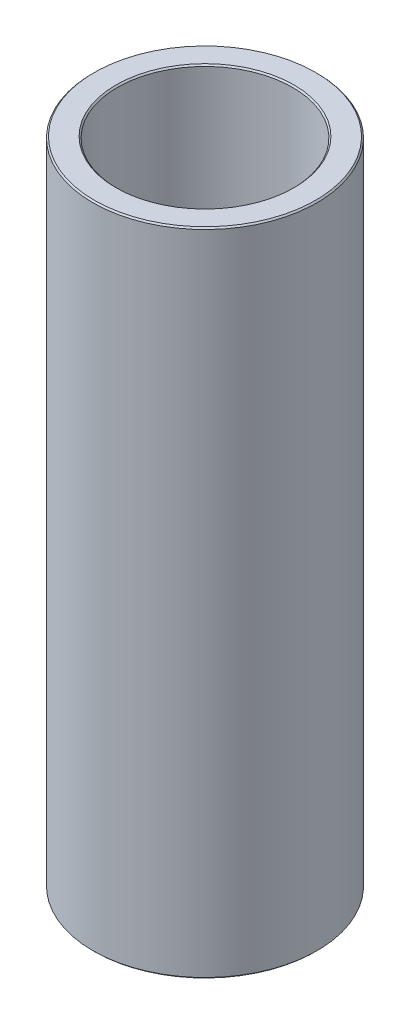
ISO-10303-21;
HEADER;
FILE_DESCRIPTION(('STEP AP214'),'2;1');
FILE_NAME('part.step','',(''),(''),'','','');
FILE_SCHEMA(('AUTOMOTIVE_DESIGN { 1 0 10303 214 1 1 1 1 }'));
ENDSEC;
DATA;
#1=APPLICATION_CONTEXT('core data for automotive mechanical design processes');
#2=APPLICATION_PROTOCOL_DEFINITION('international standard','automotive_design',2000,#1);
#3=PRODUCT_CONTEXT('',#1,'mechanical');
#4=PRODUCT('Part','Part','',(#3));
#5=PRODUCT_RELATED_PRODUCT_CATEGORY('part','',(#4));
#6=PRODUCT_DEFINITION_FORMATION('','',#4);
#7=PRODUCT_DEFINITION_CONTEXT('part definition',#1,'design');
#8=PRODUCT_DEFINITION('design','',#6,#7);
#9=PRODUCT_DEFINITION_SHAPE('','',#8);
#10=(LENGTH_UNIT() NAMED_UNIT(*) SI_UNIT(.MILLI.,.METRE.));
#11=(NAMED_UNIT(*) PLANE_ANGLE_UNIT() SI_UNIT($,.RADIAN.));
#12=(NAMED_UNIT(*) SI_UNIT($,.STERADIAN.) SOLID_ANGLE_UNIT());
#13=UNCERTAINTY_MEASURE_WITH_UNIT(LENGTH_MEASURE(1.E-05),#10,'distance_accuracy_value','');
#14=(GEOMETRIC_REPRESENTATION_CONTEXT(3) GLOBAL_UNCERTAINTY_ASSIGNED_CONTEXT((#13)) GLOBAL_UNIT_ASSIGNED_CONTEXT((#10,
#11,#12)) REPRESENTATION_CONTEXT('',''));
#15=CARTESIAN_POINT('',(0.,0.,0.));
#16=DIRECTION('',(0.,0.,1.));
#17=DIRECTION('',(1.,0.,0.));
#18=AXIS2_PLACEMENT_3D('',#15,#16,#17);
#19=CARTESIAN_POINT('',(0.,203.105967648704,0.));
#20=DIRECTION('',(0.,-1.,0.));
#21=DIRECTION('',(0.,0.,-1.));
#22=AXIS2_PLACEMENT_3D('',#19,#20,#21);
#23=CYLINDRICAL_SURFACE('',#22,35.);
#24=CARTESIAN_POINT('',(0.,0.441228143377187,0.));
#25=DIRECTION('',(0.,1.,0.));
#26=DIRECTION('',(0.,0.,1.));
#27=AXIS2_PLACEMENT_3D('',#24,#25,#26);
#28=CIRCLE('',#27,35.);
#29=CARTESIAN_POINT('',(0.,0.441228143377187,-35.));
#30=VERTEX_POINT('',#29);
#31=EDGE_CURVE('E10',#30,#30,#28,.T.);
#32=CARTESIAN_POINT('',(0.,202.664739505327,0.));
#33=DIRECTION('',(0.,1.,0.));
#34=DIRECTION('',(0.,0.,1.));
#35=AXIS2_PLACEMENT_3D('',#32,#33,#34);
#36=CIRCLE('',#35,35.);
#37=CARTESIAN_POINT('',(0.,202.664739505327,-35.));
#38=VERTEX_POINT('',#37);
#39=EDGE_CURVE('E50',#38,#38,#36,.F.);
#40=CARTESIAN_POINT('',(0.,0.441228143377187,-35.));
#41=CARTESIAN_POINT('',(0.,2.5477230533975,-35.));
#42=CARTESIAN_POINT('',(0.,4.65421796341781,-35.));
#43=CARTESIAN_POINT('',(0.,8.86720778345843,-35.));
#44=CARTESIAN_POINT('',(0.,10.9737026934787,-35.));
#45=CARTESIAN_POINT('',(0.,15.1866925135193,-35.));
#46=CARTESIAN_POINT('',(0.,17.2931874235397,-35.));
#47=CARTESIAN_POINT('',(0.,21.5061772435803,-35.));
#48=CARTESIAN_POINT('',(0.,23.6126721536006,-35.));
#49=CARTESIAN_POINT('',(0.,27.8256619736412,-35.));
#50=CARTESIAN_POINT('',(0.,29.9321568836615,-35.));
#51=CARTESIAN_POINT('',(0.,34.1451467037021,-35.));
#52=CARTESIAN_POINT('',(0.,36.2516416137225,-35.));
#53=CARTESIAN_POINT('',(0.,40.4646314337631,-35.));
#54=CARTESIAN_POINT('',(0.,42.5711263437834,-35.));
#55=CARTESIAN_POINT('',(0.,46.784116163824,-35.));
#56=CARTESIAN_POINT('',(0.,48.8906110738443,-35.));
#57=CARTESIAN_POINT('',(0.,53.1036008938849,-35.));
#58=CARTESIAN_POINT('',(0.,55.2100958039052,-35.));
#59=CARTESIAN_POINT('',(0.,59.4230856239459,-35.));
#60=CARTESIAN_POINT('',(0.,61.5295805339662,-35.));
#61=CARTESIAN_POINT('',(0.,65.7425703540068,-35.));
#62=CARTESIAN_POINT('',(0.,67.8490652640271,-35.));
#63=CARTESIAN_POINT('',(0.,72.0620550840677,-35.));
#64=CARTESIAN_POINT('',(0.,74.168549994088,-35.));
#65=CARTESIAN_POINT('',(0.,78.3815398141286,-35.));
#66=CARTESIAN_POINT('',(0.,80.4880347241489,-35.));
#67=CARTESIAN_POINT('',(0.,84.7010245441896,-35.));
#68=CARTESIAN_POINT('',(0.,86.8075194542099,-35.));
#69=CARTESIAN_POINT('',(0.,91.0205092742505,-35.));
#70=CARTESIAN_POINT('',(0.,93.1270041842708,-35.));
#71=CARTESIAN_POINT('',(0.,97.3399940043114,-35.));
#72=CARTESIAN_POINT('',(0.,99.4464889143317,-35.));
#73=CARTESIAN_POINT('',(0.,103.659478734372,-35.));
#74=CARTESIAN_POINT('',(0.,105.765973644393,-35.));
#75=CARTESIAN_POINT('',(0.,109.978963464433,-35.));
#76=CARTESIAN_POINT('',(0.,112.085458374454,-35.));
#77=CARTESIAN_POINT('',(0.,116.298448194494,-35.));
#78=CARTESIAN_POINT('',(0.,118.404943104515,-35.));
#79=CARTESIAN_POINT('',(0.,122.617932924555,-35.));
#80=CARTESIAN_POINT('',(0.,124.724427834575,-35.));
#81=CARTESIAN_POINT('',(0.,128.937417654616,-35.));
#82=CARTESIAN_POINT('',(0.,131.043912564636,-35.));
#83=CARTESIAN_POINT('',(0.,135.256902384677,-35.));
#84=CARTESIAN_POINT('',(0.,137.363397294697,-35.));
#85=CARTESIAN_POINT('',(0.,141.576387114738,-35.));
#86=CARTESIAN_POINT('',(0.,143.682882024758,-35.));
#87=CARTESIAN_POINT('',(0.,147.895871844799,-35.));
#88=CARTESIAN_POINT('',(0.,150.002366754819,-35.));
#89=CARTESIAN_POINT('',(0.,154.21535657486,-35.));
#90=CARTESIAN_POINT('',(0.,156.32185148488,-35.));
#91=CARTESIAN_POINT('',(0.,160.534841304921,-35.));
#92=CARTESIAN_POINT('',(0.,162.641336214941,-35.));
#93=CARTESIAN_POINT('',(0.,166.854326034982,-35.));
#94=CARTESIAN_POINT('',(0.,168.960820945002,-35.));
#95=CARTESIAN_POINT('',(0.,173.173810765043,-35.));
#96=CARTESIAN_POINT('',(0.,175.280305675063,-35.));
#97=CARTESIAN_POINT('',(0.,179.493295495104,-35.));
#98=CARTESIAN_POINT('',(0.,181.599790405124,-35.));
#99=CARTESIAN_POINT('',(0.,185.812780225164,-35.));
#100=CARTESIAN_POINT('',(0.,187.919275135185,-35.));
#101=CARTESIAN_POINT('',(0.,192.132264955225,-35.));
#102=CARTESIAN_POINT('',(0.,194.238759865246,-35.));
#103=CARTESIAN_POINT('',(0.,198.451749685286,-35.));
#104=CARTESIAN_POINT('',(0.,200.558244595307,-35.));
#105=CARTESIAN_POINT('',(0.,202.664739505327,-35.));
#106=B_SPLINE_CURVE_WITH_KNOTS('',3,(#40,#41,#42,#43,#44,#45,#46,#47,#48,#49,#50,#51,#52,#53,
#54,#55,#56,#57,#58,#59,#60,#61,#62,#63,#64,#65,#66,#67,#68,#69,#70,#71,#72,#73,#74,#75,#76,#77,
#78,#79,#80,#81,#82,#83,#84,#85,#86,#87,#88,#89,#90,#91,#92,#93,#94,#95,#96,#97,#98,#99,#100,
#101,#102,#103,#104,#105),.UNSPECIFIED.,.F.,.F.,(4,2,2,2,2,2,2,2,2,2,2,2,2,2,2,2,2,2,2,2,2,2,2,
2,2,2,2,2,2,2,2,2,4),(0.,6.31948473006094,12.6389694601219,18.9584541901828,25.2779389202437,
31.5974236503047,37.9169083803656,44.2363931104265,50.5558778404874,56.8753625705484,
63.1948473006093,69.5143320306702,75.8338167607311,82.1533014907921,88.472786220853,
94.7922709509139,101.111755680975,107.431240411036,113.750725141097,120.070209871158,
126.389694601219,132.70917933128,139.02866406134,145.348148791401,151.667633521462,
157.987118251523,164.306602981584,170.626087711645,176.945572441706,183.265057171767,
189.584541901828,195.904026631889,202.22351136195),.UNSPECIFIED.);
#107=EDGE_CURVE('BSEAM39',#30,#38,#106,.T.);
#108=ORIENTED_EDGE('',*,*,#31,.T.);
#109=ORIENTED_EDGE('',*,*,#39,.T.);
#110=ORIENTED_EDGE('',*,*,#107,.T.);
#111=ORIENTED_EDGE('',*,*,#107,.F.);
#112=EDGE_LOOP('',(#108,#110,#109,#111));
#113=FACE_BOUND('',#112,.T.);
#114=ADVANCED_FACE('F39',(#113),#23,.T.);
#115=CARTESIAN_POINT('',(0.,203.105967648704,0.));
#116=DIRECTION('',(0.,1.,0.));
#117=DIRECTION('',(0.,0.,1.));
#118=AXIS2_PLACEMENT_3D('',#115,#116,#117);
#119=PLANE('',#118);
#120=CARTESIAN_POINT('',(0.,203.105967648704,0.));
#121=DIRECTION('',(0.,1.,0.));
#122=DIRECTION('',(0.,0.,1.));
#123=AXIS2_PLACEMENT_3D('',#120,#121,#122);
#124=CIRCLE('',#123,27.8027280237474);
#125=CARTESIAN_POINT('',(0.,203.105967648704,27.8027280237473));
#126=VERTEX_POINT('',#125);
#127=EDGE_CURVE('E58',#126,#126,#124,.F.);
#128=ORIENTED_EDGE('',*,*,#127,.T.);
#129=EDGE_LOOP('',(#128));
#130=FACE_BOUND('',#129,.T.);
#131=CARTESIAN_POINT('',(0.,203.105967648704,0.));
#132=DIRECTION('',(0.,1.,0.));
#133=DIRECTION('',(0.,0.,1.));
#134=AXIS2_PLACEMENT_3D('',#131,#132,#133);
#135=CIRCLE('',#134,34.5587718566228);
#136=CARTESIAN_POINT('',(0.,203.105967648704,-34.5587718566228));
#137=VERTEX_POINT('',#136);
#138=EDGE_CURVE('E61',#137,#137,#135,.T.);
#139=ORIENTED_EDGE('',*,*,#138,.T.);
#140=EDGE_LOOP('',(#139));
#141=FACE_BOUND('',#140,.T.);
#142=ADVANCED_FACE('F88',(#130,#141),#119,.T.);
#143=CARTESIAN_POINT('',(0.,0.,0.));
#144=DIRECTION('',(0.,1.,0.));
#145=DIRECTION('',(0.,0.,1.));
#146=AXIS2_PLACEMENT_3D('',#143,#144,#145);
#147=PLANE('',#146);
#148=CARTESIAN_POINT('',(0.,0.,0.));
#149=DIRECTION('',(0.,1.,0.));
#150=DIRECTION('',(0.,0.,1.));
#151=AXIS2_PLACEMENT_3D('',#148,#149,#150);
#152=CIRCLE('',#151,27.8027280237474);
#153=CARTESIAN_POINT('',(0.,0.,27.8027280237474));
#154=VERTEX_POINT('',#153);
#155=EDGE_CURVE('E51',#154,#154,#152,.T.);
#156=ORIENTED_EDGE('',*,*,#155,.T.);
#157=EDGE_LOOP('',(#156));
#158=FACE_BOUND('',#157,.T.);
#159=CARTESIAN_POINT('',(0.,0.,0.));
#160=DIRECTION('',(0.,1.,0.));
#161=DIRECTION('',(0.,0.,1.));
#162=AXIS2_PLACEMENT_3D('',#159,#160,#161);
#163=CIRCLE('',#162,34.5587718566228);
#164=CARTESIAN_POINT('',(0.,0.,34.5587718566228));
#165=VERTEX_POINT('',#164);
#166=EDGE_CURVE('E54',#165,#165,#163,.F.);
#167=ORIENTED_EDGE('',*,*,#166,.T.);
#168=EDGE_LOOP('',(#167));
#169=FACE_BOUND('',#168,.T.);
#170=ADVANCED_FACE('F83',(#158,#169),#147,.F.);
#171=CARTESIAN_POINT('',(0.,203.105967648704,0.));
#172=DIRECTION('',(0.,-1.,0.));
#173=DIRECTION('',(0.,0.,-1.));
#174=AXIS2_PLACEMENT_3D('',#171,#172,#173);
#175=CYLINDRICAL_SURFACE('',#174,27.3614998803701);
#176=CARTESIAN_POINT('',(0.,202.664739505327,0.));
#177=DIRECTION('',(0.,1.,0.));
#178=DIRECTION('',(0.,0.,1.));
#179=AXIS2_PLACEMENT_3D('',#176,#177,#178);
#180=CIRCLE('',#179,27.3614998803701);
#181=CARTESIAN_POINT('',(0.,202.664739505327,27.3614998803701));
#182=VERTEX_POINT('',#181);
#183=EDGE_CURVE('E67',#182,#182,#180,.T.);
#184=ORIENTED_EDGE('',*,*,#183,.T.);
#185=EDGE_LOOP('',(#184));
#186=FACE_BOUND('',#185,.T.);
#187=CARTESIAN_POINT('',(0.,0.44122814337727,0.));
#188=DIRECTION('',(0.,1.,0.));
#189=DIRECTION('',(0.,0.,1.));
#190=AXIS2_PLACEMENT_3D('',#187,#188,#189);
#191=CIRCLE('',#190,27.3614998803701);
#192=CARTESIAN_POINT('',(0.,0.44122814337727,27.3614998803701));
#193=VERTEX_POINT('',#192);
#194=EDGE_CURVE('E69',#193,#193,#191,.F.);
#195=ORIENTED_EDGE('',*,*,#194,.T.);
#196=EDGE_LOOP('',(#195));
#197=FACE_BOUND('',#196,.T.);
#198=ADVANCED_FACE('F71',(#186,#197),#175,.F.);
#199=CARTESIAN_POINT('',(0.,202.664739505327,0.));
#200=DIRECTION('',(0.,1.,0.));
#201=DIRECTION('',(0.,0.,1.));
#202=AXIS2_PLACEMENT_3D('',#199,#200,#201);
#203=CONICAL_SURFACE('',#202,27.3614998803701,0.785398163397429);
#204=CARTESIAN_POINT('',(0.,203.105967648704,27.8027280237473));
#205=CARTESIAN_POINT('',(0.,203.101371522211,27.7981318972538));
#206=CARTESIAN_POINT('',(0.,203.096775395717,27.7935357707603));
#207=CARTESIAN_POINT('',(0.,203.08758314273,27.7843435177733));
#208=CARTESIAN_POINT('',(0.,203.082987016237,27.7797473912798));
#209=CARTESIAN_POINT('',(0.,203.07379476325,27.7705551382928));
#210=CARTESIAN_POINT('',(0.,203.069198636756,27.7659590117993));
#211=CARTESIAN_POINT('',(0.,203.060006383769,27.7567667588122));
#212=CARTESIAN_POINT('',(0.,203.055410257275,27.7521706323187));
#213=CARTESIAN_POINT('',(0.,203.046218004288,27.7429783793317));
#214=CARTESIAN_POINT('',(0.,203.041621877795,27.7383822528382));
#215=CARTESIAN_POINT('',(0.,203.032429624808,27.7291899998511));
#216=CARTESIAN_POINT('',(0.,203.027833498314,27.7245938733576));
#217=CARTESIAN_POINT('',(0.,203.018641245327,27.7154016203706));
#218=CARTESIAN_POINT('',(0.,203.014045118834,27.7108054938771));
#219=CARTESIAN_POINT('',(0.,203.004852865847,27.7016132408901));
#220=CARTESIAN_POINT('',(0.,203.000256739353,27.6970171143966));
#221=CARTESIAN_POINT('',(0.,202.991064486366,27.6878248614095));
#222=CARTESIAN_POINT('',(0.,202.986468359873,27.683228734916));
#223=CARTESIAN_POINT('',(0.,202.977276106886,27.674036481929));
#224=CARTESIAN_POINT('',(0.,202.972679980392,27.6694403554355));
#225=CARTESIAN_POINT('',(0.,202.963487727405,27.6602481024485));
#226=CARTESIAN_POINT('',(0.,202.958891600912,27.6556519759549));
#227=CARTESIAN_POINT('',(0.,202.949699347925,27.6464597229679));
#228=CARTESIAN_POINT('',(0.,202.945103221431,27.6418635964744));
#229=CARTESIAN_POINT('',(0.,202.935910968444,27.6326713434874));
#230=CARTESIAN_POINT('',(0.,202.931314841951,27.6280752169939));
#231=CARTESIAN_POINT('',(0.,202.922122588964,27.6188829640068));
#232=CARTESIAN_POINT('',(0.,202.91752646247,27.6142868375133));
#233=CARTESIAN_POINT('',(0.,202.908334209483,27.6050945845263));
#234=CARTESIAN_POINT('',(0.,202.90373808299,27.6004984580328));
#235=CARTESIAN_POINT('',(0.,202.894545830003,27.5913062050458));
#236=CARTESIAN_POINT('',(0.,202.889949703509,27.5867100785523));
#237=CARTESIAN_POINT('',(0.,202.880757450522,27.5775178255652));
#238=CARTESIAN_POINT('',(0.,202.876161324028,27.5729216990717));
#239=CARTESIAN_POINT('',(0.,202.866969071041,27.5637294460847));
#240=CARTESIAN_POINT('',(0.,202.862372944548,27.5591333195912));
#241=CARTESIAN_POINT('',(0.,202.853180691561,27.5499410666042));
#242=CARTESIAN_POINT('',(0.,202.848584565067,27.5453449401106));
#243=CARTESIAN_POINT('',(0.,202.83939231208,27.5361526871236));
#244=CARTESIAN_POINT('',(0.,202.834796185587,27.5315565606301));
#245=CARTESIAN_POINT('',(0.,202.8256039326,27.5223643076431));
#246=CARTESIAN_POINT('',(0.,202.821007806106,27.5177681811496));
#247=CARTESIAN_POINT('',(0.,202.811815553119,27.5085759281625));
#248=CARTESIAN_POINT('',(0.,202.807219426626,27.503979801669));
#249=CARTESIAN_POINT('',(0.,202.798027173639,27.494787548682));
#250=CARTESIAN_POINT('',(0.,202.793431047145,27.4901914221885));
#251=CARTESIAN_POINT('',(0.,202.784238794158,27.4809991692015));
#252=CARTESIAN_POINT('',(0.,202.779642667665,27.4764030427079));
#253=CARTESIAN_POINT('',(0.,202.770450414678,27.4672107897209));
#254=CARTESIAN_POINT('',(0.,202.765854288184,27.4626146632274));
#255=CARTESIAN_POINT('',(0.,202.756662035197,27.4534224102404));
#256=CARTESIAN_POINT('',(0.,202.752065908704,27.4488262837469));
#257=CARTESIAN_POINT('',(0.,202.742873655717,27.4396340307598));
#258=CARTESIAN_POINT('',(0.,202.738277529223,27.4350379042663));
#259=CARTESIAN_POINT('',(0.,202.729085276236,27.4258456512793));
#260=CARTESIAN_POINT('',(0.,202.724489149743,27.4212495247858));
#261=CARTESIAN_POINT('',(0.,202.715296896756,27.4120572717988));
#262=CARTESIAN_POINT('',(0.,202.710700770262,27.4074611453053));
#263=CARTESIAN_POINT('',(0.,202.701508517275,27.3982688923182));
#264=CARTESIAN_POINT('',(0.,202.696912390782,27.3936727658247));
#265=CARTESIAN_POINT('',(0.,202.687720137794,27.3844805128377));
#266=CARTESIAN_POINT('',(0.,202.683124011301,27.3798843863442));
#267=CARTESIAN_POINT('',(0.,202.673931758314,27.3706921333572));
#268=CARTESIAN_POINT('',(0.,202.66933563182,27.3660960068636));
#269=CARTESIAN_POINT('',(0.,202.664739505327,27.3614998803701));
#270=B_SPLINE_CURVE_WITH_KNOTS('',3,(#204,#205,#206,#207,#208,#209,#210,#211,#212,#213,#214,
#215,#216,#217,#218,#219,#220,#221,#222,#223,#224,#225,#226,#227,#228,#229,#230,#231,#232,#233,
#234,#235,#236,#237,#238,#239,#240,#241,#242,#243,#244,#245,#246,#247,#248,#249,#250,#251,#252,
#253,#254,#255,#256,#257,#258,#259,#260,#261,#262,#263,#264,#265,#266,#267,#268,#269),
.UNSPECIFIED.,.F.,.F.,(4,2,2,2,2,2,2,2,2,2,2,2,2,2,2,2,2,2,2,2,2,2,2,2,2,2,2,2,2,2,2,2,4),(0.,
0.0194997132645286,0.0389994265290572,0.0584991397935857,0.0779988530581143,0.0974985663226233,
0.116998279587154,0.136497992851683,0.155997706116211,0.17549741938074,0.194997132645249,
0.214496845909778,0.233996559174306,0.253496272438835,0.272995985703344,0.292495698967872,
0.311995412232401,0.331495125496932,0.35099483876146,0.370494552025969,0.389994265290498,
0.409493978555027,0.428993691819555,0.448493405084064,0.467993118348593,0.487492831613121,
0.50699254487765,0.526492258142181,0.54599197140669,0.565491684671218,0.584991397935747,
0.604491111200276,0.623990824464784),.UNSPECIFIED.);
#271=EDGE_CURVE('BSEAM77',#126,#182,#270,.T.);
#272=ORIENTED_EDGE('',*,*,#127,.F.);
#273=ORIENTED_EDGE('',*,*,#183,.F.);
#274=ORIENTED_EDGE('',*,*,#271,.T.);
#275=ORIENTED_EDGE('',*,*,#271,.F.);
#276=EDGE_LOOP('',(#272,#274,#273,#275));
#277=FACE_BOUND('',#276,.T.);
#278=ADVANCED_FACE('F77',(#277),#203,.F.);
#279=CARTESIAN_POINT('',(0.,0.,0.));
#280=DIRECTION('',(0.,-1.,0.));
#281=DIRECTION('',(0.,0.,-1.));
#282=AXIS2_PLACEMENT_3D('',#279,#280,#281);
#283=CONICAL_SURFACE('',#282,27.8027280237474,0.785398163397425);
#284=ORIENTED_EDGE('',*,*,#194,.F.);
#285=EDGE_LOOP('',(#284));
#286=FACE_BOUND('',#285,.T.);
#287=ORIENTED_EDGE('',*,*,#155,.F.);
#288=EDGE_LOOP('',(#287));
#289=FACE_BOUND('',#288,.T.);
#290=ADVANCED_FACE('F73',(#286,#289),#283,.F.);
#291=CARTESIAN_POINT('',(0.,0.441228143377187,0.));
#292=DIRECTION('',(0.,1.,0.));
#293=DIRECTION('',(0.,0.,1.));
#294=AXIS2_PLACEMENT_3D('',#291,#292,#293);
#295=CONICAL_SURFACE('',#294,35.,0.785398163397456);
#296=ORIENTED_EDGE('',*,*,#166,.F.);
#297=EDGE_LOOP('',(#296));
#298=FACE_BOUND('',#297,.T.);
#299=ORIENTED_EDGE('',*,*,#31,.F.);
#300=EDGE_LOOP('',(#299));
#301=FACE_BOUND('',#300,.T.);
#302=ADVANCED_FACE('F76',(#298,#301),#295,.T.);
#303=CARTESIAN_POINT('',(0.,203.105967648704,0.));
#304=DIRECTION('',(0.,-1.,0.));
#305=DIRECTION('',(0.,0.,-1.));
#306=AXIS2_PLACEMENT_3D('',#303,#304,#305);
#307=CONICAL_SURFACE('',#306,34.5587718566228,0.785398163397456);
#308=CARTESIAN_POINT('',(0.,202.664739505327,-35.));
#309=CARTESIAN_POINT('',(0.,202.66933563182,-34.9954038735065));
#310=CARTESIAN_POINT('',(0.,202.673931758314,-34.990807747013));
#311=CARTESIAN_POINT('',(0.,202.683124011301,-34.981615494026));
#312=CARTESIAN_POINT('',(0.,202.687720137794,-34.9770193675325));
#313=CARTESIAN_POINT('',(0.,202.696912390782,-34.9678271145454));
#314=CARTESIAN_POINT('',(0.,202.701508517275,-34.9632309880519));
#315=CARTESIAN_POINT('',(0.,202.710700770262,-34.9540387350649));
#316=CARTESIAN_POINT('',(0.,202.715296896756,-34.9494426085714));
#317=CARTESIAN_POINT('',(0.,202.724489149743,-34.9402503555844));
#318=CARTESIAN_POINT('',(0.,202.729085276236,-34.9356542290908));
#319=CARTESIAN_POINT('',(0.,202.738277529223,-34.9264619761038));
#320=CARTESIAN_POINT('',(0.,202.742873655717,-34.9218658496103));
#321=CARTESIAN_POINT('',(0.,202.752065908704,-34.9126735966233));
#322=CARTESIAN_POINT('',(0.,202.756662035197,-34.9080774701298));
#323=CARTESIAN_POINT('',(0.,202.765854288184,-34.8988852171427));
#324=CARTESIAN_POINT('',(0.,202.770450414678,-34.8942890906492));
#325=CARTESIAN_POINT('',(0.,202.779642667665,-34.8850968376622));
#326=CARTESIAN_POINT('',(0.,202.784238794158,-34.8805007111687));
#327=CARTESIAN_POINT('',(0.,202.793431047145,-34.8713084581817));
#328=CARTESIAN_POINT('',(0.,202.798027173639,-34.8667123316881));
#329=CARTESIAN_POINT('',(0.,202.807219426626,-34.8575200787011));
#330=CARTESIAN_POINT('',(0.,202.811815553119,-34.8529239522076));
#331=CARTESIAN_POINT('',(0.,202.821007806106,-34.8437316992206));
#332=CARTESIAN_POINT('',(0.,202.8256039326,-34.8391355727271));
#333=CARTESIAN_POINT('',(0.,202.834796185587,-34.82994331974));
#334=CARTESIAN_POINT('',(0.,202.83939231208,-34.8253471932465));
#335=CARTESIAN_POINT('',(0.,202.848584565067,-34.8161549402595));
#336=CARTESIAN_POINT('',(0.,202.853180691561,-34.811558813766));
#337=CARTESIAN_POINT('',(0.,202.862372944548,-34.802366560779));
#338=CARTESIAN_POINT('',(0.,202.866969071041,-34.7977704342855));
#339=CARTESIAN_POINT('',(0.,202.876161324028,-34.7885781812984));
#340=CARTESIAN_POINT('',(0.,202.880757450522,-34.7839820548049));
#341=CARTESIAN_POINT('',(0.,202.889949703509,-34.7747898018179));
#342=CARTESIAN_POINT('',(0.,202.894545830003,-34.7701936753244));
#343=CARTESIAN_POINT('',(0.,202.90373808299,-34.7610014223373));
#344=CARTESIAN_POINT('',(0.,202.908334209483,-34.7564052958438));
#345=CARTESIAN_POINT('',(0.,202.91752646247,-34.7472130428568));
#346=CARTESIAN_POINT('',(0.,202.922122588964,-34.7426169163633));
#347=CARTESIAN_POINT('',(0.,202.931314841951,-34.7334246633763));
#348=CARTESIAN_POINT('',(0.,202.935910968444,-34.7288285368828));
#349=CARTESIAN_POINT('',(0.,202.945103221431,-34.7196362838957));
#350=CARTESIAN_POINT('',(0.,202.949699347925,-34.7150401574022));
#351=CARTESIAN_POINT('',(0.,202.958891600912,-34.7058479044152));
#352=CARTESIAN_POINT('',(0.,202.963487727405,-34.7012517779217));
#353=CARTESIAN_POINT('',(0.,202.972679980392,-34.6920595249347));
#354=CARTESIAN_POINT('',(0.,202.977276106886,-34.6874633984411));
#355=CARTESIAN_POINT('',(0.,202.986468359873,-34.6782711454541));
#356=CARTESIAN_POINT('',(0.,202.991064486366,-34.6736750189606));
#357=CARTESIAN_POINT('',(0.,203.000256739353,-34.6644827659736));
#358=CARTESIAN_POINT('',(0.,203.004852865847,-34.6598866394801));
#359=CARTESIAN_POINT('',(0.,203.014045118834,-34.650694386493));
#360=CARTESIAN_POINT('',(0.,203.018641245327,-34.6460982599995));
#361=CARTESIAN_POINT('',(0.,203.027833498314,-34.6369060070125));
#362=CARTESIAN_POINT('',(0.,203.032429624808,-34.632309880519));
#363=CARTESIAN_POINT('',(0.,203.041621877795,-34.623117627532));
#364=CARTESIAN_POINT('',(0.,203.046218004288,-34.6185215010384));
#365=CARTESIAN_POINT('',(0.,203.055410257275,-34.6093292480514));
#366=CARTESIAN_POINT('',(0.,203.060006383769,-34.6047331215579));
#367=CARTESIAN_POINT('',(0.,203.069198636756,-34.5955408685709));
#368=CARTESIAN_POINT('',(0.,203.07379476325,-34.5909447420774));
#369=CARTESIAN_POINT('',(0.,203.082987016237,-34.5817524890903));
#370=CARTESIAN_POINT('',(0.,203.08758314273,-34.5771563625968));
#371=CARTESIAN_POINT('',(0.,203.096775395717,-34.5679641096098));
#372=CARTESIAN_POINT('',(0.,203.101371522211,-34.5633679831163));
#373=CARTESIAN_POINT('',(0.,203.105967648704,-34.5587718566228));
#374=B_SPLINE_CURVE_WITH_KNOTS('',3,(#308,#309,#310,#311,#312,#313,#314,#315,#316,#317,#318,
#319,#320,#321,#322,#323,#324,#325,#326,#327,#328,#329,#330,#331,#332,#333,#334,#335,#336,#337,
#338,#339,#340,#341,#342,#343,#344,#345,#346,#347,#348,#349,#350,#351,#352,#353,#354,#355,#356,
#357,#358,#359,#360,#361,#362,#363,#364,#365,#366,#367,#368,#369,#370,#371,#372,#373),
.UNSPECIFIED.,.F.,.F.,(4,2,2,2,2,2,2,2,2,2,2,2,2,2,2,2,2,2,2,2,2,2,2,2,2,2,2,2,2,2,2,2,4),(0.,
0.0194997132645286,0.0389994265290572,0.0584991397935857,0.0779988530581192,0.0974985663226282,
0.116998279587157,0.136497992851685,0.155997706116214,0.175497419380742,0.194997132645256,
0.214496845909785,0.233996559174313,0.253496272438842,0.272995985703351,0.29249569896788,
0.311995412232408,0.331495125496942,0.35099483876147,0.370494552025979,0.389994265290508,
0.409493978555036,0.428993691819565,0.448493405084079,0.467993118348607,0.487492831613136,
0.506992544877665,0.526492258142193,0.545991971406702,0.565491684671235,0.584991397935764,
0.604491111200293,0.623990824464821),.UNSPECIFIED.);
#375=EDGE_CURVE('BSEAM45',#38,#137,#374,.T.);
#376=ORIENTED_EDGE('',*,*,#39,.F.);
#377=ORIENTED_EDGE('',*,*,#138,.F.);
#378=ORIENTED_EDGE('',*,*,#375,.T.);
#379=ORIENTED_EDGE('',*,*,#375,.F.);
#380=EDGE_LOOP('',(#376,#378,#377,#379));
#381=FACE_BOUND('',#380,.T.);
#382=ADVANCED_FACE('F45',(#381),#307,.T.);
#383=CLOSED_SHELL('',(#114,#142,#170,#198,#278,#290,#302,#382));
#384=MANIFOLD_SOLID_BREP('B2',#383);
#385=ADVANCED_BREP_SHAPE_REPRESENTATION('',(#18,#384),#14);
#386=SHAPE_DEFINITION_REPRESENTATION(#9,#385);
ENDSEC;
END-ISO-10303-21;
